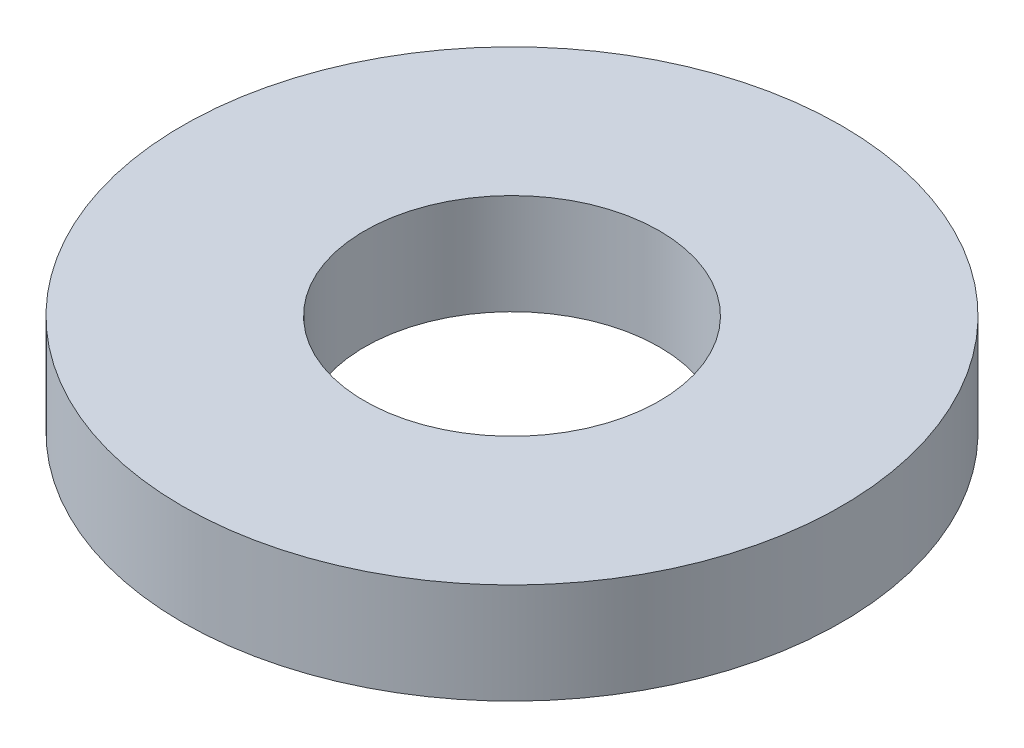
ISO-10303-21;
HEADER;
FILE_DESCRIPTION(('STEP AP214'),'2;1');
FILE_NAME('part.step','',(''),(''),'','','');
FILE_SCHEMA(('AUTOMOTIVE_DESIGN { 1 0 10303 214 1 1 1 1 }'));
ENDSEC;
DATA;
#1=APPLICATION_CONTEXT('core data for automotive mechanical design processes');
#2=APPLICATION_PROTOCOL_DEFINITION('international standard','automotive_design',2000,#1);
#3=PRODUCT_CONTEXT('',#1,'mechanical');
#4=PRODUCT('Part','Part','',(#3));
#5=PRODUCT_RELATED_PRODUCT_CATEGORY('part','',(#4));
#6=PRODUCT_DEFINITION_FORMATION('','',#4);
#7=PRODUCT_DEFINITION_CONTEXT('part definition',#1,'design');
#8=PRODUCT_DEFINITION('design','',#6,#7);
#9=PRODUCT_DEFINITION_SHAPE('','',#8);
#10=(LENGTH_UNIT() NAMED_UNIT(*) SI_UNIT(.MILLI.,.METRE.));
#11=(NAMED_UNIT(*) PLANE_ANGLE_UNIT() SI_UNIT($,.RADIAN.));
#12=(NAMED_UNIT(*) SI_UNIT($,.STERADIAN.) SOLID_ANGLE_UNIT());
#13=UNCERTAINTY_MEASURE_WITH_UNIT(LENGTH_MEASURE(1.E-05),#10,'distance_accuracy_value','');
#14=(GEOMETRIC_REPRESENTATION_CONTEXT(3) GLOBAL_UNCERTAINTY_ASSIGNED_CONTEXT((#13)) GLOBAL_UNIT_ASSIGNED_CONTEXT((#10,
#11,#12)) REPRESENTATION_CONTEXT('',''));
#15=CARTESIAN_POINT('',(0.,0.,0.));
#16=DIRECTION('',(0.,0.,1.));
#17=DIRECTION('',(1.,0.,0.));
#18=AXIS2_PLACEMENT_3D('',#15,#16,#17);
#19=CARTESIAN_POINT('',(0.,29.,0.));
#20=DIRECTION('',(0.,-1.,0.));
#21=DIRECTION('',(0.,0.,-1.));
#22=AXIS2_PLACEMENT_3D('',#19,#20,#21);
#23=CYLINDRICAL_SURFACE('',#22,95.);
#24=CARTESIAN_POINT('',(0.,29.,0.));
#25=DIRECTION('',(0.,1.,0.));
#26=DIRECTION('',(0.,0.,1.));
#27=AXIS2_PLACEMENT_3D('',#24,#25,#26);
#28=CIRCLE('',#27,95.);
#29=CARTESIAN_POINT('',(0.,29.,-95.));
#30=VERTEX_POINT('',#29);
#31=EDGE_CURVE('E10',#30,#30,#28,.T.);
#32=CARTESIAN_POINT('',(0.,0.,0.));
#33=DIRECTION('',(0.,1.,0.));
#34=DIRECTION('',(0.,0.,1.));
#35=AXIS2_PLACEMENT_3D('',#32,#33,#34);
#36=CIRCLE('',#35,95.);
#37=CARTESIAN_POINT('',(0.,0.,-95.));
#38=VERTEX_POINT('',#37);
#39=EDGE_CURVE('E37',#38,#38,#36,.T.);
#40=CARTESIAN_POINT('',(0.,29.,-95.));
#41=CARTESIAN_POINT('',(0.,28.6979166666667,-95.));
#42=CARTESIAN_POINT('',(0.,28.3958333333333,-95.));
#43=CARTESIAN_POINT('',(0.,27.7916666666667,-95.));
#44=CARTESIAN_POINT('',(0.,27.4895833333333,-95.));
#45=CARTESIAN_POINT('',(0.,26.8854166666667,-95.));
#46=CARTESIAN_POINT('',(0.,26.5833333333333,-95.));
#47=CARTESIAN_POINT('',(0.,25.9791666666667,-95.));
#48=CARTESIAN_POINT('',(0.,25.6770833333333,-95.));
#49=CARTESIAN_POINT('',(0.,25.0729166666667,-95.));
#50=CARTESIAN_POINT('',(0.,24.7708333333333,-95.));
#51=CARTESIAN_POINT('',(0.,24.1666666666667,-95.));
#52=CARTESIAN_POINT('',(0.,23.8645833333333,-95.));
#53=CARTESIAN_POINT('',(0.,23.2604166666667,-95.));
#54=CARTESIAN_POINT('',(0.,22.9583333333333,-95.));
#55=CARTESIAN_POINT('',(0.,22.3541666666667,-95.));
#56=CARTESIAN_POINT('',(0.,22.0520833333333,-95.));
#57=CARTESIAN_POINT('',(0.,21.4479166666667,-95.));
#58=CARTESIAN_POINT('',(0.,21.1458333333333,-95.));
#59=CARTESIAN_POINT('',(0.,20.5416666666667,-95.));
#60=CARTESIAN_POINT('',(0.,20.2395833333333,-95.));
#61=CARTESIAN_POINT('',(0.,19.6354166666667,-95.));
#62=CARTESIAN_POINT('',(0.,19.3333333333333,-95.));
#63=CARTESIAN_POINT('',(0.,18.7291666666667,-95.));
#64=CARTESIAN_POINT('',(0.,18.4270833333333,-95.));
#65=CARTESIAN_POINT('',(0.,17.8229166666667,-95.));
#66=CARTESIAN_POINT('',(0.,17.5208333333333,-95.));
#67=CARTESIAN_POINT('',(0.,16.9166666666667,-95.));
#68=CARTESIAN_POINT('',(0.,16.6145833333333,-95.));
#69=CARTESIAN_POINT('',(0.,16.0104166666667,-95.));
#70=CARTESIAN_POINT('',(0.,15.7083333333333,-95.));
#71=CARTESIAN_POINT('',(0.,15.1041666666667,-95.));
#72=CARTESIAN_POINT('',(0.,14.8020833333333,-95.));
#73=CARTESIAN_POINT('',(0.,14.1979166666667,-95.));
#74=CARTESIAN_POINT('',(0.,13.8958333333333,-95.));
#75=CARTESIAN_POINT('',(0.,13.2916666666667,-95.));
#76=CARTESIAN_POINT('',(0.,12.9895833333333,-95.));
#77=CARTESIAN_POINT('',(0.,12.3854166666667,-95.));
#78=CARTESIAN_POINT('',(0.,12.0833333333333,-95.));
#79=CARTESIAN_POINT('',(0.,11.4791666666667,-95.));
#80=CARTESIAN_POINT('',(0.,11.1770833333333,-95.));
#81=CARTESIAN_POINT('',(0.,10.5729166666667,-95.));
#82=CARTESIAN_POINT('',(0.,10.2708333333333,-95.));
#83=CARTESIAN_POINT('',(0.,9.66666666666667,-95.));
#84=CARTESIAN_POINT('',(0.,9.36458333333333,-95.));
#85=CARTESIAN_POINT('',(0.,8.76041666666667,-95.));
#86=CARTESIAN_POINT('',(0.,8.45833333333333,-95.));
#87=CARTESIAN_POINT('',(0.,7.85416666666667,-95.));
#88=CARTESIAN_POINT('',(0.,7.55208333333333,-95.));
#89=CARTESIAN_POINT('',(0.,6.94791666666667,-95.));
#90=CARTESIAN_POINT('',(0.,6.64583333333333,-95.));
#91=CARTESIAN_POINT('',(0.,6.04166666666667,-95.));
#92=CARTESIAN_POINT('',(0.,5.73958333333333,-95.));
#93=CARTESIAN_POINT('',(0.,5.13541666666667,-95.));
#94=CARTESIAN_POINT('',(0.,4.83333333333333,-95.));
#95=CARTESIAN_POINT('',(0.,4.22916666666667,-95.));
#96=CARTESIAN_POINT('',(0.,3.92708333333333,-95.));
#97=CARTESIAN_POINT('',(0.,3.32291666666667,-95.));
#98=CARTESIAN_POINT('',(0.,3.02083333333333,-95.));
#99=CARTESIAN_POINT('',(0.,2.41666666666667,-95.));
#100=CARTESIAN_POINT('',(0.,2.11458333333333,-95.));
#101=CARTESIAN_POINT('',(0.,1.51041666666667,-95.));
#102=CARTESIAN_POINT('',(0.,1.20833333333333,-95.));
#103=CARTESIAN_POINT('',(0.,0.604166666666667,-95.));
#104=CARTESIAN_POINT('',(0.,0.302083333333333,-95.));
#105=CARTESIAN_POINT('',(0.,0.,-95.));
#106=B_SPLINE_CURVE_WITH_KNOTS('',3,(#40,#41,#42,#43,#44,#45,#46,#47,#48,#49,#50,#51,#52,#53,
#54,#55,#56,#57,#58,#59,#60,#61,#62,#63,#64,#65,#66,#67,#68,#69,#70,#71,#72,#73,#74,#75,#76,#77,
#78,#79,#80,#81,#82,#83,#84,#85,#86,#87,#88,#89,#90,#91,#92,#93,#94,#95,#96,#97,#98,#99,#100,
#101,#102,#103,#104,#105),.UNSPECIFIED.,.F.,.F.,(4,2,2,2,2,2,2,2,2,2,2,2,2,2,2,2,2,2,2,2,2,2,2,
2,2,2,2,2,2,2,2,2,4),(0.,0.906249999999997,1.8125,2.71875,3.625,4.53125,5.4375,6.34375,7.25,
8.15625,9.0625,9.96875,10.875,11.78125,12.6875,13.59375,14.5,15.40625,16.3125,17.21875,18.125,
19.03125,19.9375,20.84375,21.75,22.65625,23.5625,24.46875,25.375,26.28125,27.1875,28.09375,29.),.UNSPECIFIED.);
#107=EDGE_CURVE('BSEAM40',#30,#38,#106,.T.);
#108=ORIENTED_EDGE('',*,*,#31,.F.);
#109=ORIENTED_EDGE('',*,*,#39,.T.);
#110=ORIENTED_EDGE('',*,*,#107,.T.);
#111=ORIENTED_EDGE('',*,*,#107,.F.);
#112=EDGE_LOOP('',(#108,#110,#109,#111));
#113=FACE_BOUND('',#112,.T.);
#114=ADVANCED_FACE('F40',(#113),#23,.T.);
#115=CARTESIAN_POINT('',(0.,29.,0.));
#116=DIRECTION('',(0.,1.,0.));
#117=DIRECTION('',(0.,0.,1.));
#118=AXIS2_PLACEMENT_3D('',#115,#116,#117);
#119=PLANE('',#118);
#120=CARTESIAN_POINT('',(0.,29.,0.));
#121=DIRECTION('',(0.,1.,0.));
#122=DIRECTION('',(0.,0.,1.));
#123=AXIS2_PLACEMENT_3D('',#120,#121,#122);
#124=CIRCLE('',#123,42.5);
#125=CARTESIAN_POINT('',(0.,29.,-42.5));
#126=VERTEX_POINT('',#125);
#127=EDGE_CURVE('E50',#126,#126,#124,.T.);
#128=ORIENTED_EDGE('',*,*,#127,.F.);
#129=EDGE_LOOP('',(#128));
#130=FACE_BOUND('',#129,.T.);
#131=ORIENTED_EDGE('',*,*,#31,.T.);
#132=EDGE_LOOP('',(#131));
#133=FACE_BOUND('',#132,.T.);
#134=ADVANCED_FACE('F59',(#130,#133),#119,.T.);
#135=CARTESIAN_POINT('',(0.,0.,0.));
#136=DIRECTION('',(0.,1.,0.));
#137=DIRECTION('',(0.,0.,1.));
#138=AXIS2_PLACEMENT_3D('',#135,#136,#137);
#139=PLANE('',#138);
#140=CARTESIAN_POINT('',(0.,0.,0.));
#141=DIRECTION('',(0.,1.,0.));
#142=DIRECTION('',(0.,0.,1.));
#143=AXIS2_PLACEMENT_3D('',#140,#141,#142);
#144=CIRCLE('',#143,42.5);
#145=CARTESIAN_POINT('',(0.,0.,-42.5));
#146=VERTEX_POINT('',#145);
#147=EDGE_CURVE('E47',#146,#146,#144,.T.);
#148=ORIENTED_EDGE('',*,*,#147,.T.);
#149=EDGE_LOOP('',(#148));
#150=FACE_BOUND('',#149,.T.);
#151=ORIENTED_EDGE('',*,*,#39,.F.);
#152=EDGE_LOOP('',(#151));
#153=FACE_BOUND('',#152,.T.);
#154=ADVANCED_FACE('F58',(#150,#153),#139,.F.);
#155=CARTESIAN_POINT('',(0.,29.,0.));
#156=DIRECTION('',(0.,-1.,0.));
#157=DIRECTION('',(0.,0.,-1.));
#158=AXIS2_PLACEMENT_3D('',#155,#156,#157);
#159=CYLINDRICAL_SURFACE('',#158,42.5);
#160=CARTESIAN_POINT('',(0.,29.,-42.5));
#161=CARTESIAN_POINT('',(0.,28.6979166666667,-42.5));
#162=CARTESIAN_POINT('',(0.,28.3958333333333,-42.5));
#163=CARTESIAN_POINT('',(0.,27.7916666666667,-42.5));
#164=CARTESIAN_POINT('',(0.,27.4895833333333,-42.5));
#165=CARTESIAN_POINT('',(0.,26.8854166666667,-42.5));
#166=CARTESIAN_POINT('',(0.,26.5833333333333,-42.5));
#167=CARTESIAN_POINT('',(0.,25.9791666666667,-42.5));
#168=CARTESIAN_POINT('',(0.,25.6770833333333,-42.5));
#169=CARTESIAN_POINT('',(0.,25.0729166666667,-42.5));
#170=CARTESIAN_POINT('',(0.,24.7708333333333,-42.5));
#171=CARTESIAN_POINT('',(0.,24.1666666666667,-42.5));
#172=CARTESIAN_POINT('',(0.,23.8645833333333,-42.5));
#173=CARTESIAN_POINT('',(0.,23.2604166666667,-42.5));
#174=CARTESIAN_POINT('',(0.,22.9583333333333,-42.5));
#175=CARTESIAN_POINT('',(0.,22.3541666666667,-42.5));
#176=CARTESIAN_POINT('',(0.,22.0520833333333,-42.5));
#177=CARTESIAN_POINT('',(0.,21.4479166666667,-42.5));
#178=CARTESIAN_POINT('',(0.,21.1458333333333,-42.5));
#179=CARTESIAN_POINT('',(0.,20.5416666666667,-42.5));
#180=CARTESIAN_POINT('',(0.,20.2395833333333,-42.5));
#181=CARTESIAN_POINT('',(0.,19.6354166666667,-42.5));
#182=CARTESIAN_POINT('',(0.,19.3333333333333,-42.5));
#183=CARTESIAN_POINT('',(0.,18.7291666666667,-42.5));
#184=CARTESIAN_POINT('',(0.,18.4270833333333,-42.5));
#185=CARTESIAN_POINT('',(0.,17.8229166666667,-42.5));
#186=CARTESIAN_POINT('',(0.,17.5208333333333,-42.5));
#187=CARTESIAN_POINT('',(0.,16.9166666666667,-42.5));
#188=CARTESIAN_POINT('',(0.,16.6145833333333,-42.5));
#189=CARTESIAN_POINT('',(0.,16.0104166666667,-42.5));
#190=CARTESIAN_POINT('',(0.,15.7083333333333,-42.5));
#191=CARTESIAN_POINT('',(0.,15.1041666666667,-42.5));
#192=CARTESIAN_POINT('',(0.,14.8020833333333,-42.5));
#193=CARTESIAN_POINT('',(0.,14.1979166666667,-42.5));
#194=CARTESIAN_POINT('',(0.,13.8958333333333,-42.5));
#195=CARTESIAN_POINT('',(0.,13.2916666666667,-42.5));
#196=CARTESIAN_POINT('',(0.,12.9895833333333,-42.5));
#197=CARTESIAN_POINT('',(0.,12.3854166666667,-42.5));
#198=CARTESIAN_POINT('',(0.,12.0833333333333,-42.5));
#199=CARTESIAN_POINT('',(0.,11.4791666666667,-42.5));
#200=CARTESIAN_POINT('',(0.,11.1770833333333,-42.5));
#201=CARTESIAN_POINT('',(0.,10.5729166666667,-42.5));
#202=CARTESIAN_POINT('',(0.,10.2708333333333,-42.5));
#203=CARTESIAN_POINT('',(0.,9.66666666666667,-42.5));
#204=CARTESIAN_POINT('',(0.,9.36458333333333,-42.5));
#205=CARTESIAN_POINT('',(0.,8.76041666666667,-42.5));
#206=CARTESIAN_POINT('',(0.,8.45833333333333,-42.5));
#207=CARTESIAN_POINT('',(0.,7.85416666666667,-42.5));
#208=CARTESIAN_POINT('',(0.,7.55208333333333,-42.5));
#209=CARTESIAN_POINT('',(0.,6.94791666666667,-42.5));
#210=CARTESIAN_POINT('',(0.,6.64583333333333,-42.5));
#211=CARTESIAN_POINT('',(0.,6.04166666666667,-42.5));
#212=CARTESIAN_POINT('',(0.,5.73958333333333,-42.5));
#213=CARTESIAN_POINT('',(0.,5.13541666666667,-42.5));
#214=CARTESIAN_POINT('',(0.,4.83333333333333,-42.5));
#215=CARTESIAN_POINT('',(0.,4.22916666666667,-42.5));
#216=CARTESIAN_POINT('',(0.,3.92708333333333,-42.5));
#217=CARTESIAN_POINT('',(0.,3.32291666666667,-42.5));
#218=CARTESIAN_POINT('',(0.,3.02083333333333,-42.5));
#219=CARTESIAN_POINT('',(0.,2.41666666666667,-42.5));
#220=CARTESIAN_POINT('',(0.,2.11458333333333,-42.5));
#221=CARTESIAN_POINT('',(0.,1.51041666666667,-42.5));
#222=CARTESIAN_POINT('',(0.,1.20833333333333,-42.5));
#223=CARTESIAN_POINT('',(0.,0.604166666666667,-42.5));
#224=CARTESIAN_POINT('',(0.,0.302083333333333,-42.5));
#225=CARTESIAN_POINT('',(0.,0.,-42.5));
#226=B_SPLINE_CURVE_WITH_KNOTS('',3,(#160,#161,#162,#163,#164,#165,#166,#167,#168,#169,#170,
#171,#172,#173,#174,#175,#176,#177,#178,#179,#180,#181,#182,#183,#184,#185,#186,#187,#188,#189,
#190,#191,#192,#193,#194,#195,#196,#197,#198,#199,#200,#201,#202,#203,#204,#205,#206,#207,#208,
#209,#210,#211,#212,#213,#214,#215,#216,#217,#218,#219,#220,#221,#222,#223,#224,#225),
.UNSPECIFIED.,.F.,.F.,(4,2,2,2,2,2,2,2,2,2,2,2,2,2,2,2,2,2,2,2,2,2,2,2,2,2,2,2,2,2,2,2,4),(0.,
0.906249999999997,1.8125,2.71875,3.625,4.53125,5.4375,6.34375,7.25,8.15625,9.0625,9.96875,
10.875,11.78125,12.6875,13.59375,14.5,15.40625,16.3125,17.21875,18.125,19.03125,19.9375,
20.84375,21.75,22.65625,23.5625,24.46875,25.375,26.28125,27.1875,28.09375,29.),.UNSPECIFIED.);
#227=EDGE_CURVE('BSEAM54',#126,#146,#226,.T.);
#228=ORIENTED_EDGE('',*,*,#127,.T.);
#229=ORIENTED_EDGE('',*,*,#147,.F.);
#230=ORIENTED_EDGE('',*,*,#227,.T.);
#231=ORIENTED_EDGE('',*,*,#227,.F.);
#232=EDGE_LOOP('',(#228,#230,#229,#231));
#233=FACE_BOUND('',#232,.T.);
#234=ADVANCED_FACE('F54',(#233),#159,.F.);
#235=CLOSED_SHELL('',(#114,#134,#154,#234));
#236=MANIFOLD_SOLID_BREP('B2',#235);
#237=ADVANCED_BREP_SHAPE_REPRESENTATION('',(#18,#236),#14);
#238=SHAPE_DEFINITION_REPRESENTATION(#9,#237);
ENDSEC;
END-ISO-10303-21;
